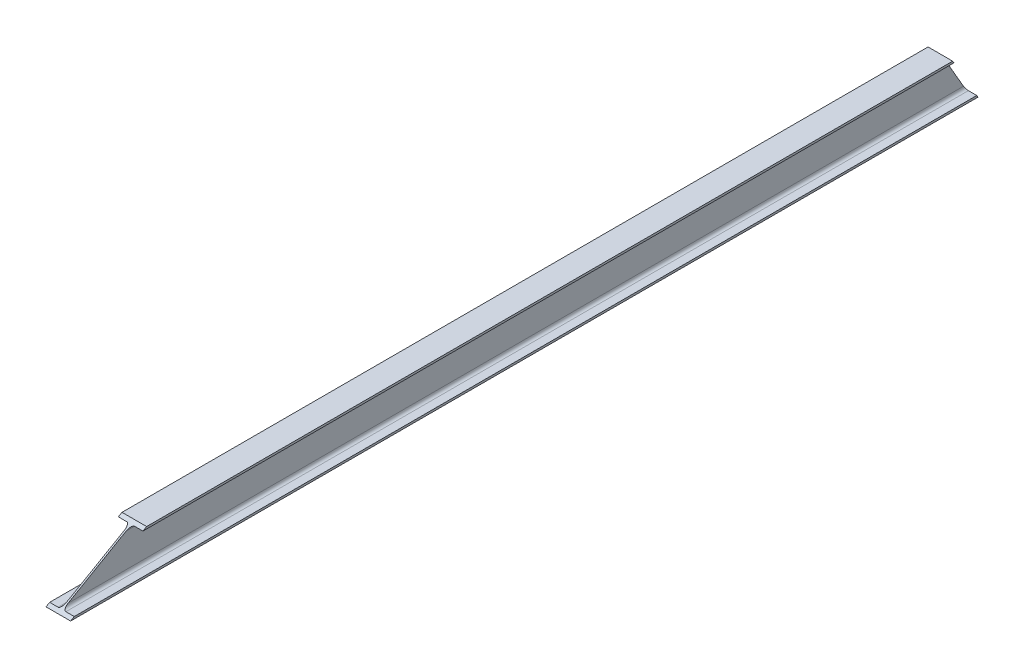
ISO-10303-21;
HEADER;
FILE_DESCRIPTION(('STEP AP214'),'2;1');
FILE_NAME('part.step','',(''),(''),'','','');
FILE_SCHEMA(('AUTOMOTIVE_DESIGN { 1 0 10303 214 1 1 1 1 }'));
ENDSEC;
DATA;
#1=APPLICATION_CONTEXT('core data for automotive mechanical design processes');
#2=APPLICATION_PROTOCOL_DEFINITION('international standard','automotive_design',2000,#1);
#3=PRODUCT_CONTEXT('',#1,'mechanical');
#4=PRODUCT('Part','Part','',(#3));
#5=PRODUCT_RELATED_PRODUCT_CATEGORY('part','',(#4));
#6=PRODUCT_DEFINITION_FORMATION('','',#4);
#7=PRODUCT_DEFINITION_CONTEXT('part definition',#1,'design');
#8=PRODUCT_DEFINITION('design','',#6,#7);
#9=PRODUCT_DEFINITION_SHAPE('','',#8);
#10=(LENGTH_UNIT() NAMED_UNIT(*) SI_UNIT(.MILLI.,.METRE.));
#11=(NAMED_UNIT(*) PLANE_ANGLE_UNIT() SI_UNIT($,.RADIAN.));
#12=(NAMED_UNIT(*) SI_UNIT($,.STERADIAN.) SOLID_ANGLE_UNIT());
#13=UNCERTAINTY_MEASURE_WITH_UNIT(LENGTH_MEASURE(1.E-05),#10,'distance_accuracy_value','');
#14=(GEOMETRIC_REPRESENTATION_CONTEXT(3) GLOBAL_UNCERTAINTY_ASSIGNED_CONTEXT((#13)) GLOBAL_UNIT_ASSIGNED_CONTEXT((#10,
#11,#12)) REPRESENTATION_CONTEXT('',''));
#15=CARTESIAN_POINT('',(0.,0.,0.));
#16=DIRECTION('',(0.,0.,1.));
#17=DIRECTION('',(1.,0.,0.));
#18=AXIS2_PLACEMENT_3D('',#15,#16,#17);
#19=CARTESIAN_POINT('',(-27.5,44.3,2032.));
#20=DIRECTION('',(1.,0.,0.));
#21=DIRECTION('',(0.,1.,0.));
#22=AXIS2_PLACEMENT_3D('',#19,#20,#21);
#23=PLANE('',#22);
#24=DIRECTION('',(0.,0.,-1.));
#25=VECTOR('',#24,1.);
#26=CARTESIAN_POINT('',(-27.5,44.3,2032.));
#27=LINE('',#26,#25);
#28=CARTESIAN_POINT('',(-27.5,44.3,1865.31965965382));
#29=VERTEX_POINT('',#28);
#30=CARTESIAN_POINT('',(-27.5,44.2999999999999,53.866780115392));
#31=VERTEX_POINT('',#30);
#32=EDGE_CURVE('E49',#29,#31,#27,.T.);
#33=ORIENTED_EDGE('',*,*,#32,.F.);
#34=DIRECTION('',(0.,0.499999999999998,-0.86602540378444));
#35=VECTOR('',#34,1.);
#36=CARTESIAN_POINT('',(-27.5000000000001,-27.8747045256122,1990.32991491346));
#37=LINE('',#36,#35);
#38=CARTESIAN_POINT('',(-27.5,49.,1857.17902085825));
#39=VERTEX_POINT('',#38);
#40=EDGE_CURVE('E337',#29,#39,#37,.T.);
#41=ORIENTED_EDGE('',*,*,#40,.T.);
#42=DIRECTION('',(0.,0.,-1.));
#43=VECTOR('',#42,1.);
#44=CARTESIAN_POINT('',(-27.5,49.,2032.));
#45=LINE('',#44,#43);
#46=CARTESIAN_POINT('',(-27.5,49.,56.5803263805833));
#47=VERTEX_POINT('',#46);
#48=EDGE_CURVE('E217',#39,#47,#45,.T.);
#49=ORIENTED_EDGE('',*,*,#48,.T.);
#50=DIRECTION('',(0.,0.866025403784438,0.500000000000001));
#51=VECTOR('',#50,1.);
#52=CARTESIAN_POINT('',(-27.4999999999994,900.856810244991,548.400085086546));
#53=LINE('',#52,#51);
#54=EDGE_CURVE('E209',#31,#47,#53,.T.);
#55=ORIENTED_EDGE('',*,*,#54,.F.);
#56=EDGE_LOOP('',(#33,#41,#49,#55));
#57=FACE_BOUND('',#56,.T.);
#58=ADVANCED_FACE('F41',(#57),#23,.F.);
#59=CARTESIAN_POINT('',(-8.8,44.3,2032.));
#60=DIRECTION('',(0.,1.,0.));
#61=DIRECTION('',(0.,0.,1.));
#62=AXIS2_PLACEMENT_3D('',#59,#60,#61);
#63=PLANE('',#62);
#64=DIRECTION('',(0.,0.,-1.));
#65=VECTOR('',#64,1.);
#66=CARTESIAN_POINT('',(-8.8,44.3,2032.));
#67=LINE('',#66,#65);
#68=CARTESIAN_POINT('',(-8.8,44.3,1865.31965965382));
#69=VERTEX_POINT('',#68);
#70=CARTESIAN_POINT('',(-8.8,44.3,53.866780115392));
#71=VERTEX_POINT('',#70);
#72=EDGE_CURVE('E188',#69,#71,#67,.T.);
#73=ORIENTED_EDGE('',*,*,#72,.F.);
#74=DIRECTION('',(-1.,0.,0.));
#75=VECTOR('',#74,1.);
#76=CARTESIAN_POINT('',(-8.8,44.3,1865.31965965382));
#77=LINE('',#76,#75);
#78=EDGE_CURVE('E199',#69,#29,#77,.T.);
#79=ORIENTED_EDGE('',*,*,#78,.T.);
#80=ORIENTED_EDGE('',*,*,#32,.T.);
#81=DIRECTION('',(-1.,0.,0.));
#82=VECTOR('',#81,1.);
#83=CARTESIAN_POINT('',(-8.8,44.3,53.866780115392));
#84=LINE('',#83,#82);
#85=EDGE_CURVE('E198',#71,#31,#84,.T.);
#86=ORIENTED_EDGE('',*,*,#85,.F.);
#87=EDGE_LOOP('',(#73,#79,#80,#86));
#88=FACE_BOUND('',#87,.T.);
#89=ADVANCED_FACE('F197',(#88),#63,.F.);
#90=CARTESIAN_POINT('',(-8.8,37.3,2032.));
#91=DIRECTION('',(0.,0.,-1.));
#92=DIRECTION('',(-1.,0.,0.));
#93=AXIS2_PLACEMENT_3D('',#90,#91,#92);
#94=CYLINDRICAL_SURFACE('',#93,7.);
#95=DIRECTION('',(0.,0.,-1.));
#96=VECTOR('',#95,1.);
#97=CARTESIAN_POINT('',(-1.8,37.3,2032.));
#98=LINE('',#97,#96);
#99=CARTESIAN_POINT('',(-1.8,37.3,1877.44401530681));
#100=VERTEX_POINT('',#99);
#101=CARTESIAN_POINT('',(-1.8,37.3,49.8253282310646));
#102=VERTEX_POINT('',#101);
#103=EDGE_CURVE('E185',#100,#102,#98,.T.);
#104=ORIENTED_EDGE('',*,*,#103,.F.);
#105=CARTESIAN_POINT('',(-8.8,37.3,1877.44401530681));
#106=DIRECTION('',(0.,-0.86602540378444,-0.499999999999998));
#107=DIRECTION('',(0.,0.499999999999998,-0.86602540378444));
#108=AXIS2_PLACEMENT_3D('',#105,#106,#107);
#109=ELLIPSE('',#108,14.0000000000001,7.);
#110=EDGE_CURVE('E342',#100,#69,#109,.F.);
#111=ORIENTED_EDGE('',*,*,#110,.T.);
#112=ORIENTED_EDGE('',*,*,#72,.T.);
#113=CARTESIAN_POINT('',(-8.8,37.3,49.8253282310646));
#114=DIRECTION('',(0.,0.500000000000001,-0.866025403784438));
#115=DIRECTION('',(0.,-0.866025403784438,-0.500000000000001));
#116=AXIS2_PLACEMENT_3D('',#113,#114,#115);
#117=ELLIPSE('',#116,8.08290376865477,7.);
#118=EDGE_CURVE('E213',#102,#71,#117,.F.);
#119=ORIENTED_EDGE('',*,*,#118,.F.);
#120=EDGE_LOOP('',(#104,#111,#112,#119));
#121=FACE_BOUND('',#120,.T.);
#122=ADVANCED_FACE('F376',(#121),#94,.F.);
#123=CARTESIAN_POINT('',(-1.8,-37.3,2032.));
#124=DIRECTION('',(1.,0.,0.));
#125=DIRECTION('',(0.,0.,-1.));
#126=AXIS2_PLACEMENT_3D('',#123,#124,#125);
#127=PLANE('',#126);
#128=DIRECTION('',(0.,0.,-1.));
#129=VECTOR('',#128,1.);
#130=CARTESIAN_POINT('',(-1.8,-37.3,2032.));
#131=LINE('',#130,#129);
#132=CARTESIAN_POINT('',(-1.8,-37.3,2006.65500555144));
#133=VERTEX_POINT('',#132);
#134=CARTESIAN_POINT('',(-1.8,-37.3,6.75499814951874));
#135=VERTEX_POINT('',#134);
#136=EDGE_CURVE('E182',#133,#135,#131,.T.);
#137=ORIENTED_EDGE('',*,*,#136,.F.);
#138=DIRECTION('',(0.,0.499999999999998,-0.86602540378444));
#139=VECTOR('',#138,1.);
#140=CARTESIAN_POINT('',(-1.8,-48.2747045256121,2025.66375138786));
#141=LINE('',#140,#139);
#142=EDGE_CURVE('E346',#133,#100,#141,.T.);
#143=ORIENTED_EDGE('',*,*,#142,.T.);
#144=ORIENTED_EDGE('',*,*,#103,.T.);
#145=DIRECTION('',(0.,0.866025403784438,0.500000000000001));
#146=VECTOR('',#145,1.);
#147=CARTESIAN_POINT('',(-1.8,839.656810244991,513.066248612141));
#148=LINE('',#147,#146);
#149=EDGE_CURVE('E228',#135,#102,#148,.T.);
#150=ORIENTED_EDGE('',*,*,#149,.F.);
#151=EDGE_LOOP('',(#137,#143,#144,#150));
#152=FACE_BOUND('',#151,.T.);
#153=ADVANCED_FACE('F373',(#152),#127,.F.);
#154=CARTESIAN_POINT('',(-8.8,-37.3,2032.));
#155=DIRECTION('',(0.,0.,-1.));
#156=DIRECTION('',(-1.,0.,0.));
#157=AXIS2_PLACEMENT_3D('',#154,#155,#156);
#158=CYLINDRICAL_SURFACE('',#157,7.);
#159=DIRECTION('',(0.,0.,-1.));
#160=VECTOR('',#159,1.);
#161=CARTESIAN_POINT('',(-8.8,-44.3,2032.));
#162=LINE('',#161,#160);
#163=CARTESIAN_POINT('',(-8.8,-44.3,2018.77936120443));
#164=VERTEX_POINT('',#163);
#165=CARTESIAN_POINT('',(-8.8,-44.3,2.71354626519127));
#166=VERTEX_POINT('',#165);
#167=EDGE_CURVE('E179',#164,#166,#162,.T.);
#168=ORIENTED_EDGE('',*,*,#167,.F.);
#169=CARTESIAN_POINT('',(-8.8,-37.3,2006.65500555144));
#170=DIRECTION('',(0.,-0.86602540378444,-0.499999999999998));
#171=DIRECTION('',(0.,0.499999999999998,-0.86602540378444));
#172=AXIS2_PLACEMENT_3D('',#169,#170,#171);
#173=ELLIPSE('',#172,14.0000000000001,7.);
#174=EDGE_CURVE('E350',#164,#133,#173,.F.);
#175=ORIENTED_EDGE('',*,*,#174,.T.);
#176=ORIENTED_EDGE('',*,*,#136,.T.);
#177=CARTESIAN_POINT('',(-8.8,-37.3,6.75499814951852));
#178=DIRECTION('',(0.,0.500000000000001,-0.866025403784438));
#179=DIRECTION('',(0.,-0.866025403784438,-0.500000000000001));
#180=AXIS2_PLACEMENT_3D('',#177,#178,#179);
#181=ELLIPSE('',#180,8.08290376865477,7.);
#182=EDGE_CURVE('E231',#166,#135,#181,.F.);
#183=ORIENTED_EDGE('',*,*,#182,.F.);
#184=EDGE_LOOP('',(#168,#175,#176,#183));
#185=FACE_BOUND('',#184,.T.);
#186=ADVANCED_FACE('F370',(#185),#158,.F.);
#187=CARTESIAN_POINT('',(-27.5,-44.3,2032.));
#188=DIRECTION('',(0.,-1.,0.));
#189=DIRECTION('',(1.,0.,0.));
#190=AXIS2_PLACEMENT_3D('',#187,#188,#189);
#191=PLANE('',#190);
#192=DIRECTION('',(0.,0.,-1.));
#193=VECTOR('',#192,1.);
#194=CARTESIAN_POINT('',(-27.5,-44.3,2032.));
#195=LINE('',#194,#193);
#196=CARTESIAN_POINT('',(-27.5,-44.3,2018.77936120443));
#197=VERTEX_POINT('',#196);
#198=CARTESIAN_POINT('',(-27.5,-44.3,2.71354626519127));
#199=VERTEX_POINT('',#198);
#200=EDGE_CURVE('E171',#197,#199,#195,.T.);
#201=ORIENTED_EDGE('',*,*,#200,.F.);
#202=DIRECTION('',(1.,0.,0.));
#203=VECTOR('',#202,1.);
#204=CARTESIAN_POINT('',(-27.5,-44.3,2018.77936120443));
#205=LINE('',#204,#203);
#206=EDGE_CURVE('E354',#197,#164,#205,.T.);
#207=ORIENTED_EDGE('',*,*,#206,.T.);
#208=ORIENTED_EDGE('',*,*,#167,.T.);
#209=DIRECTION('',(1.,0.,0.));
#210=VECTOR('',#209,1.);
#211=CARTESIAN_POINT('',(-27.5000000000004,-44.3,2.71354626519127));
#212=LINE('',#211,#210);
#213=EDGE_CURVE('E235',#199,#166,#212,.T.);
#214=ORIENTED_EDGE('',*,*,#213,.F.);
#215=EDGE_LOOP('',(#201,#207,#208,#214));
#216=FACE_BOUND('',#215,.T.);
#217=ADVANCED_FACE('F365',(#216),#191,.F.);
#218=CARTESIAN_POINT('',(-27.5,-49.,2032.));
#219=DIRECTION('',(1.,0.,0.));
#220=DIRECTION('',(0.,0.,-1.));
#221=AXIS2_PLACEMENT_3D('',#218,#219,#220);
#222=PLANE('',#221);
#223=DIRECTION('',(0.,0.,-1.));
#224=VECTOR('',#223,1.);
#225=CARTESIAN_POINT('',(-27.5,-49.,2032.));
#226=LINE('',#225,#224);
#227=CARTESIAN_POINT('',(-27.5,-49.,2026.92));
#228=VERTEX_POINT('',#227);
#229=CARTESIAN_POINT('',(-27.5,-49.,0.));
#230=VERTEX_POINT('',#229);
#231=EDGE_CURVE('E167',#228,#230,#226,.T.);
#232=ORIENTED_EDGE('',*,*,#231,.F.);
#233=DIRECTION('',(0.,0.499999999999998,-0.86602540378444));
#234=VECTOR('',#233,1.);
#235=CARTESIAN_POINT('',(-27.5,-51.199704525612,2030.73));
#236=LINE('',#235,#234);
#237=EDGE_CURVE('E56',#228,#197,#236,.T.);
#238=ORIENTED_EDGE('',*,*,#237,.T.);
#239=ORIENTED_EDGE('',*,*,#200,.T.);
#240=DIRECTION('',(0.,0.866025403784438,0.500000000000001));
#241=VECTOR('',#240,1.);
#242=CARTESIAN_POINT('',(-27.5,830.881810244991,508.000000000002));
#243=LINE('',#242,#241);
#244=EDGE_CURVE('E239',#230,#199,#243,.T.);
#245=ORIENTED_EDGE('',*,*,#244,.F.);
#246=EDGE_LOOP('',(#232,#238,#239,#245));
#247=FACE_BOUND('',#246,.T.);
#248=ADVANCED_FACE('F361',(#247),#222,.F.);
#249=CARTESIAN_POINT('',(27.5,-44.3,2032.));
#250=DIRECTION('',(-1.,0.,0.));
#251=DIRECTION('',(0.,0.,1.));
#252=AXIS2_PLACEMENT_3D('',#249,#250,#251);
#253=PLANE('',#252);
#254=DIRECTION('',(0.,0.,-1.));
#255=VECTOR('',#254,1.);
#256=CARTESIAN_POINT('',(27.5,-44.3,2032.));
#257=LINE('',#256,#255);
#258=CARTESIAN_POINT('',(27.5,-44.3,2018.77936120443));
#259=VERTEX_POINT('',#258);
#260=CARTESIAN_POINT('',(27.5,-44.3000000000001,2.71354626519116));
#261=VERTEX_POINT('',#260);
#262=EDGE_CURVE('E159',#259,#261,#257,.T.);
#263=ORIENTED_EDGE('',*,*,#262,.F.);
#264=DIRECTION('',(0.,-0.499999999999998,0.86602540378444));
#265=VECTOR('',#264,1.);
#266=CARTESIAN_POINT('',(27.5,-50.024704525612,2028.69484030111));
#267=LINE('',#266,#265);
#268=CARTESIAN_POINT('',(27.5,-49.,2026.92));
#269=VERTEX_POINT('',#268);
#270=EDGE_CURVE('E153',#259,#269,#267,.T.);
#271=ORIENTED_EDGE('',*,*,#270,.T.);
#272=DIRECTION('',(0.,0.,-1.));
#273=VECTOR('',#272,1.);
#274=CARTESIAN_POINT('',(27.5,-49.,2032.));
#275=LINE('',#274,#273);
#276=CARTESIAN_POINT('',(27.5,-49.,0.));
#277=VERTEX_POINT('',#276);
#278=EDGE_CURVE('E63',#269,#277,#275,.T.);
#279=ORIENTED_EDGE('',*,*,#278,.T.);
#280=DIRECTION('',(0.,-0.866025403784438,-0.500000000000001));
#281=VECTOR('',#280,1.);
#282=CARTESIAN_POINT('',(27.5,834.406810244991,510.035159698895));
#283=LINE('',#282,#281);
#284=EDGE_CURVE('E282',#261,#277,#283,.T.);
#285=ORIENTED_EDGE('',*,*,#284,.F.);
#286=EDGE_LOOP('',(#263,#271,#279,#285));
#287=FACE_BOUND('',#286,.T.);
#288=ADVANCED_FACE('F158',(#287),#253,.F.);
#289=CARTESIAN_POINT('',(8.80000000000001,-44.3,2032.));
#290=DIRECTION('',(0.,-1.,0.));
#291=DIRECTION('',(1.,0.,0.));
#292=AXIS2_PLACEMENT_3D('',#289,#290,#291);
#293=PLANE('',#292);
#294=DIRECTION('',(0.,0.,-1.));
#295=VECTOR('',#294,1.);
#296=CARTESIAN_POINT('',(8.80000000000001,-44.3,2032.));
#297=LINE('',#296,#295);
#298=CARTESIAN_POINT('',(8.80000000000001,-44.3,2018.77936120443));
#299=VERTEX_POINT('',#298);
#300=CARTESIAN_POINT('',(8.80000000000001,-44.3,2.71354626519127));
#301=VERTEX_POINT('',#300);
#302=EDGE_CURVE('E173',#299,#301,#297,.T.);
#303=ORIENTED_EDGE('',*,*,#302,.F.);
#304=DIRECTION('',(1.,0.,0.));
#305=VECTOR('',#304,1.);
#306=CARTESIAN_POINT('',(8.8,-44.3,2018.77936120443));
#307=LINE('',#306,#305);
#308=EDGE_CURVE('E285',#299,#259,#307,.T.);
#309=ORIENTED_EDGE('',*,*,#308,.T.);
#310=ORIENTED_EDGE('',*,*,#262,.T.);
#311=DIRECTION('',(1.,0.,0.));
#312=VECTOR('',#311,1.);
#313=CARTESIAN_POINT('',(8.80000000000044,-44.3,2.71354626519127));
#314=LINE('',#313,#312);
#315=EDGE_CURVE('E274',#301,#261,#314,.T.);
#316=ORIENTED_EDGE('',*,*,#315,.F.);
#317=EDGE_LOOP('',(#303,#309,#310,#316));
#318=FACE_BOUND('',#317,.T.);
#319=ADVANCED_FACE('F280',(#318),#293,.F.);
#320=CARTESIAN_POINT('',(8.80000000000001,-37.3,2032.));
#321=DIRECTION('',(0.,0.,-1.));
#322=DIRECTION('',(-1.,0.,0.));
#323=AXIS2_PLACEMENT_3D('',#320,#321,#322);
#324=CYLINDRICAL_SURFACE('',#323,7.);
#325=DIRECTION('',(0.,0.,-1.));
#326=VECTOR('',#325,1.);
#327=CARTESIAN_POINT('',(1.80000000000001,-37.3,2032.));
#328=LINE('',#327,#326);
#329=CARTESIAN_POINT('',(1.80000000000001,-37.3,2006.65500555144));
#330=VERTEX_POINT('',#329);
#331=CARTESIAN_POINT('',(1.80000000000001,-37.3,6.75499814951852));
#332=VERTEX_POINT('',#331);
#333=EDGE_CURVE('E258',#330,#332,#328,.T.);
#334=ORIENTED_EDGE('',*,*,#333,.F.);
#335=CARTESIAN_POINT('',(8.80000000000001,-37.3,2006.65500555144));
#336=DIRECTION('',(0.,-0.86602540378444,-0.499999999999998));
#337=DIRECTION('',(0.,0.499999999999998,-0.86602540378444));
#338=AXIS2_PLACEMENT_3D('',#335,#336,#337);
#339=ELLIPSE('',#338,14.0000000000001,7.);
#340=EDGE_CURVE('E269',#330,#299,#339,.F.);
#341=ORIENTED_EDGE('',*,*,#340,.T.);
#342=ORIENTED_EDGE('',*,*,#302,.T.);
#343=CARTESIAN_POINT('',(8.80000000000001,-37.3,6.75499814951852));
#344=DIRECTION('',(0.,0.500000000000001,-0.866025403784438));
#345=DIRECTION('',(0.,-0.866025403784438,-0.500000000000001));
#346=AXIS2_PLACEMENT_3D('',#343,#344,#345);
#347=ELLIPSE('',#346,8.08290376865477,7.);
#348=EDGE_CURVE('E268',#332,#301,#347,.F.);
#349=ORIENTED_EDGE('',*,*,#348,.F.);
#350=EDGE_LOOP('',(#334,#341,#342,#349));
#351=FACE_BOUND('',#350,.T.);
#352=ADVANCED_FACE('F267',(#351),#324,.F.);
#353=CARTESIAN_POINT('',(1.8,37.3,2032.));
#354=DIRECTION('',(-1.,0.,0.));
#355=DIRECTION('',(0.,-1.,0.));
#356=AXIS2_PLACEMENT_3D('',#353,#354,#355);
#357=PLANE('',#356);
#358=DIRECTION('',(0.,0.,-1.));
#359=VECTOR('',#358,1.);
#360=CARTESIAN_POINT('',(1.8,37.3,2032.));
#361=LINE('',#360,#359);
#362=CARTESIAN_POINT('',(1.8,37.3,1877.44401530681));
#363=VERTEX_POINT('',#362);
#364=CARTESIAN_POINT('',(1.8,37.3000000000001,49.8253282310648));
#365=VERTEX_POINT('',#364);
#366=EDGE_CURVE('E255',#363,#365,#361,.T.);
#367=ORIENTED_EDGE('',*,*,#366,.F.);
#368=DIRECTION('',(0.,-0.499999999999998,0.86602540378444));
#369=VECTOR('',#368,1.);
#370=CARTESIAN_POINT('',(1.80000000000001,-29.6247045256122,1993.3610038267));
#371=LINE('',#370,#369);
#372=EDGE_CURVE('E318',#363,#330,#371,.T.);
#373=ORIENTED_EDGE('',*,*,#372,.T.);
#374=ORIENTED_EDGE('',*,*,#333,.T.);
#375=DIRECTION('',(0.,-0.866025403784438,-0.500000000000001));
#376=VECTOR('',#375,1.);
#377=CARTESIAN_POINT('',(1.79999999999989,895.606810244991,545.368996173301));
#378=LINE('',#377,#376);
#379=EDGE_CURVE('E277',#365,#332,#378,.T.);
#380=ORIENTED_EDGE('',*,*,#379,.F.);
#381=EDGE_LOOP('',(#367,#373,#374,#380));
#382=FACE_BOUND('',#381,.T.);
#383=ADVANCED_FACE('F316',(#382),#357,.F.);
#384=CARTESIAN_POINT('',(8.8,37.3,2032.));
#385=DIRECTION('',(0.,0.,-1.));
#386=DIRECTION('',(-1.,0.,0.));
#387=AXIS2_PLACEMENT_3D('',#384,#385,#386);
#388=CYLINDRICAL_SURFACE('',#387,7.);
#389=DIRECTION('',(0.,0.,-1.));
#390=VECTOR('',#389,1.);
#391=CARTESIAN_POINT('',(8.8,44.3,2032.));
#392=LINE('',#391,#390);
#393=CARTESIAN_POINT('',(8.8,44.3,1865.31965965382));
#394=VERTEX_POINT('',#393);
#395=CARTESIAN_POINT('',(8.8,44.3,53.866780115392));
#396=VERTEX_POINT('',#395);
#397=EDGE_CURVE('E252',#394,#396,#392,.T.);
#398=ORIENTED_EDGE('',*,*,#397,.F.);
#399=CARTESIAN_POINT('',(8.8,37.3,1877.44401530681));
#400=DIRECTION('',(0.,-0.86602540378444,-0.499999999999998));
#401=DIRECTION('',(0.,0.499999999999998,-0.86602540378444));
#402=AXIS2_PLACEMENT_3D('',#399,#400,#401);
#403=ELLIPSE('',#402,14.0000000000001,7.);
#404=EDGE_CURVE('E313',#394,#363,#403,.F.);
#405=ORIENTED_EDGE('',*,*,#404,.T.);
#406=ORIENTED_EDGE('',*,*,#366,.T.);
#407=CARTESIAN_POINT('',(8.8,37.3,49.8253282310646));
#408=DIRECTION('',(0.,0.500000000000001,-0.866025403784438));
#409=DIRECTION('',(0.,-0.866025403784438,-0.500000000000001));
#410=AXIS2_PLACEMENT_3D('',#407,#408,#409);
#411=ELLIPSE('',#410,8.08290376865476,7.);
#412=EDGE_CURVE('E291',#396,#365,#411,.F.);
#413=ORIENTED_EDGE('',*,*,#412,.F.);
#414=EDGE_LOOP('',(#398,#405,#406,#413));
#415=FACE_BOUND('',#414,.T.);
#416=ADVANCED_FACE('F312',(#415),#388,.F.);
#417=CARTESIAN_POINT('',(27.5,44.3,2032.));
#418=DIRECTION('',(0.,1.,0.));
#419=DIRECTION('',(0.,0.,1.));
#420=AXIS2_PLACEMENT_3D('',#417,#418,#419);
#421=PLANE('',#420);
#422=DIRECTION('',(0.,0.,-1.));
#423=VECTOR('',#422,1.);
#424=CARTESIAN_POINT('',(27.5,44.3,2032.));
#425=LINE('',#424,#423);
#426=CARTESIAN_POINT('',(27.5,44.3,1865.31965965382));
#427=VERTEX_POINT('',#426);
#428=CARTESIAN_POINT('',(27.5,44.3,53.866780115392));
#429=VERTEX_POINT('',#428);
#430=EDGE_CURVE('E249',#427,#429,#425,.T.);
#431=ORIENTED_EDGE('',*,*,#430,.F.);
#432=DIRECTION('',(-1.,0.,0.));
#433=VECTOR('',#432,1.);
#434=CARTESIAN_POINT('',(27.5,44.3,1865.31965965382));
#435=LINE('',#434,#433);
#436=EDGE_CURVE('E309',#427,#394,#435,.T.);
#437=ORIENTED_EDGE('',*,*,#436,.T.);
#438=ORIENTED_EDGE('',*,*,#397,.T.);
#439=DIRECTION('',(-1.,0.,0.));
#440=VECTOR('',#439,1.);
#441=CARTESIAN_POINT('',(27.5,44.3,53.866780115392));
#442=LINE('',#441,#440);
#443=EDGE_CURVE('E294',#429,#396,#442,.T.);
#444=ORIENTED_EDGE('',*,*,#443,.F.);
#445=EDGE_LOOP('',(#431,#437,#438,#444));
#446=FACE_BOUND('',#445,.T.);
#447=ADVANCED_FACE('F306',(#446),#421,.F.);
#448=CARTESIAN_POINT('',(27.5,49.,2032.));
#449=DIRECTION('',(-1.,0.,0.));
#450=DIRECTION('',(0.,0.,1.));
#451=AXIS2_PLACEMENT_3D('',#448,#449,#450);
#452=PLANE('',#451);
#453=DIRECTION('',(0.,0.,-1.));
#454=VECTOR('',#453,1.);
#455=CARTESIAN_POINT('',(27.5,49.,2032.));
#456=LINE('',#455,#454);
#457=CARTESIAN_POINT('',(27.5,49.,1857.17902085825));
#458=VERTEX_POINT('',#457);
#459=CARTESIAN_POINT('',(27.5,49.,56.5803263805836));
#460=VERTEX_POINT('',#459);
#461=EDGE_CURVE('E246',#458,#460,#456,.T.);
#462=ORIENTED_EDGE('',*,*,#461,.F.);
#463=DIRECTION('',(0.,-0.499999999999998,0.86602540378444));
#464=VECTOR('',#463,1.);
#465=CARTESIAN_POINT('',(27.5,-26.6997045256122,1988.29475521456));
#466=LINE('',#465,#464);
#467=EDGE_CURVE('E329',#458,#427,#466,.T.);
#468=ORIENTED_EDGE('',*,*,#467,.T.);
#469=ORIENTED_EDGE('',*,*,#430,.T.);
#470=DIRECTION('',(0.,-0.866025403784438,-0.500000000000001));
#471=VECTOR('',#470,1.);
#472=CARTESIAN_POINT('',(27.5,904.381810244991,550.43524478544));
#473=LINE('',#472,#471);
#474=EDGE_CURVE('E222',#460,#429,#473,.T.);
#475=ORIENTED_EDGE('',*,*,#474,.F.);
#476=EDGE_LOOP('',(#462,#468,#469,#475));
#477=FACE_BOUND('',#476,.T.);
#478=ADVANCED_FACE('F379',(#477),#452,.F.);
#479=CARTESIAN_POINT('',(-27.5,49.,2032.));
#480=DIRECTION('',(0.,-1.,0.));
#481=DIRECTION('',(0.,0.,-1.));
#482=AXIS2_PLACEMENT_3D('',#479,#480,#481);
#483=PLANE('',#482);
#484=ORIENTED_EDGE('',*,*,#48,.F.);
#485=DIRECTION('',(1.,0.,0.));
#486=VECTOR('',#485,1.);
#487=CARTESIAN_POINT('',(-27.5,49.,1857.17902085825));
#488=LINE('',#487,#486);
#489=EDGE_CURVE('E333',#39,#458,#488,.T.);
#490=ORIENTED_EDGE('',*,*,#489,.T.);
#491=ORIENTED_EDGE('',*,*,#461,.T.);
#492=DIRECTION('',(1.,0.,0.));
#493=VECTOR('',#492,1.);
#494=CARTESIAN_POINT('',(-27.5,49.,56.5803263805833));
#495=LINE('',#494,#493);
#496=EDGE_CURVE('E219',#47,#460,#495,.T.);
#497=ORIENTED_EDGE('',*,*,#496,.F.);
#498=EDGE_LOOP('',(#484,#490,#491,#497));
#499=FACE_BOUND('',#498,.T.);
#500=ADVANCED_FACE('F378',(#499),#483,.F.);
#501=CARTESIAN_POINT('',(27.5,-49.,2032.));
#502=DIRECTION('',(0.,1.,0.));
#503=DIRECTION('',(-1.,0.,0.));
#504=AXIS2_PLACEMENT_3D('',#501,#502,#503);
#505=PLANE('',#504);
#506=ORIENTED_EDGE('',*,*,#278,.F.);
#507=DIRECTION('',(-1.,0.,0.));
#508=VECTOR('',#507,1.);
#509=CARTESIAN_POINT('',(27.5,-49.,2026.92));
#510=LINE('',#509,#508);
#511=EDGE_CURVE('E11',#269,#228,#510,.T.);
#512=ORIENTED_EDGE('',*,*,#511,.T.);
#513=ORIENTED_EDGE('',*,*,#231,.T.);
#514=DIRECTION('',(1.,0.,0.));
#515=VECTOR('',#514,1.);
#516=CARTESIAN_POINT('',(27.5,-49.,0.));
#517=LINE('',#516,#515);
#518=EDGE_CURVE('E165',#230,#277,#517,.T.);
#519=ORIENTED_EDGE('',*,*,#518,.T.);
#520=EDGE_LOOP('',(#506,#512,#513,#519));
#521=FACE_BOUND('',#520,.T.);
#522=ADVANCED_FACE('F163',(#521),#505,.F.);
#523=CARTESIAN_POINT('',(0.,-12.25,21.2176223927188));
#524=DIRECTION('',(0.,0.500000000000001,-0.866025403784438));
#525=DIRECTION('',(0.,0.866025403784438,0.500000000000001));
#526=AXIS2_PLACEMENT_3D('',#523,#524,#525);
#527=PLANE('',#526);
#528=ORIENTED_EDGE('',*,*,#244,.T.);
#529=ORIENTED_EDGE('',*,*,#213,.T.);
#530=ORIENTED_EDGE('',*,*,#182,.T.);
#531=ORIENTED_EDGE('',*,*,#149,.T.);
#532=ORIENTED_EDGE('',*,*,#118,.T.);
#533=ORIENTED_EDGE('',*,*,#85,.T.);
#534=ORIENTED_EDGE('',*,*,#54,.T.);
#535=ORIENTED_EDGE('',*,*,#496,.T.);
#536=ORIENTED_EDGE('',*,*,#474,.T.);
#537=ORIENTED_EDGE('',*,*,#443,.T.);
#538=ORIENTED_EDGE('',*,*,#412,.T.);
#539=ORIENTED_EDGE('',*,*,#379,.T.);
#540=ORIENTED_EDGE('',*,*,#348,.T.);
#541=ORIENTED_EDGE('',*,*,#315,.T.);
#542=ORIENTED_EDGE('',*,*,#284,.T.);
#543=ORIENTED_EDGE('',*,*,#518,.F.);
#544=EDGE_LOOP('',(#528,#529,#530,#531,#532,#533,#534,#535,#536,#537,#538,#539,#540,#541,#542,#543));
#545=FACE_BOUND('',#544,.T.);
#546=ADVANCED_FACE('F207',(#545),#527,.T.);
#547=CARTESIAN_POINT('',(0.,840.932105719375,485.512377607277));
#548=DIRECTION('',(0.,-0.86602540378444,-0.499999999999998));
#549=DIRECTION('',(0.,0.499999999999998,-0.86602540378444));
#550=AXIS2_PLACEMENT_3D('',#547,#548,#549);
#551=PLANE('',#550);
#552=ORIENTED_EDGE('',*,*,#340,.F.);
#553=ORIENTED_EDGE('',*,*,#372,.F.);
#554=ORIENTED_EDGE('',*,*,#404,.F.);
#555=ORIENTED_EDGE('',*,*,#436,.F.);
#556=ORIENTED_EDGE('',*,*,#467,.F.);
#557=ORIENTED_EDGE('',*,*,#489,.F.);
#558=ORIENTED_EDGE('',*,*,#40,.F.);
#559=ORIENTED_EDGE('',*,*,#78,.F.);
#560=ORIENTED_EDGE('',*,*,#110,.F.);
#561=ORIENTED_EDGE('',*,*,#142,.F.);
#562=ORIENTED_EDGE('',*,*,#174,.F.);
#563=ORIENTED_EDGE('',*,*,#206,.F.);
#564=ORIENTED_EDGE('',*,*,#237,.F.);
#565=ORIENTED_EDGE('',*,*,#511,.F.);
#566=ORIENTED_EDGE('',*,*,#270,.F.);
#567=ORIENTED_EDGE('',*,*,#308,.F.);
#568=EDGE_LOOP('',(#552,#553,#554,#555,#556,#557,#558,#559,#560,#561,#562,#563,#564,#565,#566,#567));
#569=FACE_BOUND('',#568,.T.);
#570=ADVANCED_FACE('F152',(#569),#551,.F.);
#571=CLOSED_SHELL('',(#58,#89,#122,#153,#186,#217,#248,#288,#319,#352,#383,#416,#447,#478,#500,
#522,#546,#570));
#572=MANIFOLD_SOLID_BREP('B2',#571);
#573=ADVANCED_BREP_SHAPE_REPRESENTATION('',(#18,#572),#14);
#574=SHAPE_DEFINITION_REPRESENTATION(#9,#573);
ENDSEC;
END-ISO-10303-21;
